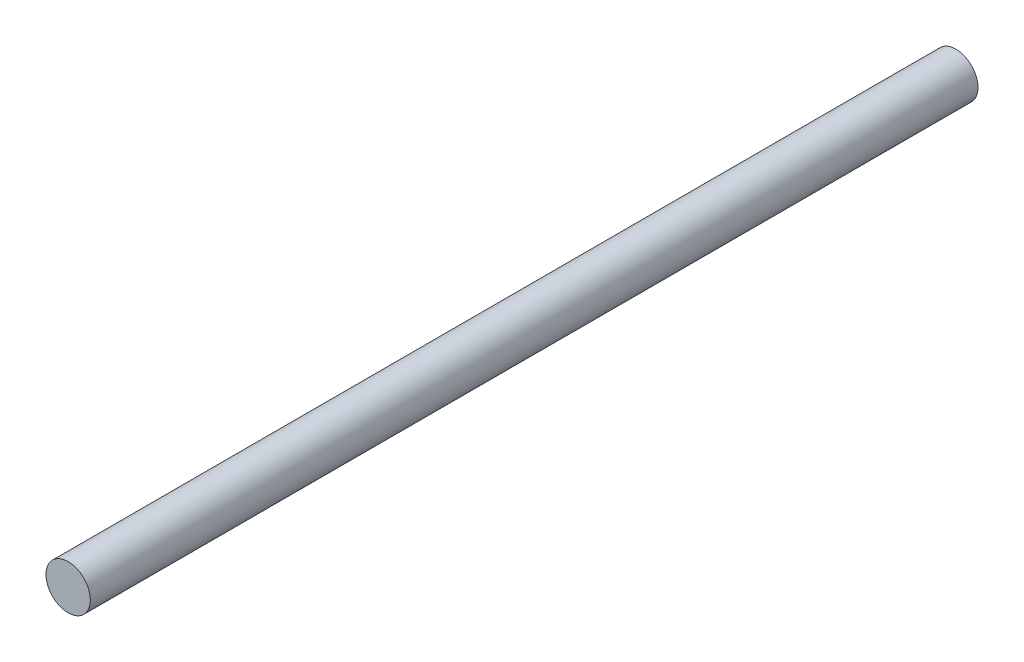
ISO-10303-21;
HEADER;
FILE_DESCRIPTION(('STEP AP214'),'2;1');
FILE_NAME('part.step','',(''),(''),'','','');
FILE_SCHEMA(('AUTOMOTIVE_DESIGN { 1 0 10303 214 1 1 1 1 }'));
ENDSEC;
DATA;
#1=APPLICATION_CONTEXT('core data for automotive mechanical design processes');
#2=APPLICATION_PROTOCOL_DEFINITION('international standard','automotive_design',2000,#1);
#3=PRODUCT_CONTEXT('',#1,'mechanical');
#4=PRODUCT('Part','Part','',(#3));
#5=PRODUCT_RELATED_PRODUCT_CATEGORY('part','',(#4));
#6=PRODUCT_DEFINITION_FORMATION('','',#4);
#7=PRODUCT_DEFINITION_CONTEXT('part definition',#1,'design');
#8=PRODUCT_DEFINITION('design','',#6,#7);
#9=PRODUCT_DEFINITION_SHAPE('','',#8);
#10=(LENGTH_UNIT() NAMED_UNIT(*) SI_UNIT(.MILLI.,.METRE.));
#11=(NAMED_UNIT(*) PLANE_ANGLE_UNIT() SI_UNIT($,.RADIAN.));
#12=(NAMED_UNIT(*) SI_UNIT($,.STERADIAN.) SOLID_ANGLE_UNIT());
#13=UNCERTAINTY_MEASURE_WITH_UNIT(LENGTH_MEASURE(1.E-05),#10,'distance_accuracy_value','');
#14=(GEOMETRIC_REPRESENTATION_CONTEXT(3) GLOBAL_UNCERTAINTY_ASSIGNED_CONTEXT((#13)) GLOBAL_UNIT_ASSIGNED_CONTEXT((#10,
#11,#12)) REPRESENTATION_CONTEXT('',''));
#15=CARTESIAN_POINT('',(0.,0.,0.));
#16=DIRECTION('',(0.,0.,1.));
#17=DIRECTION('',(1.,0.,0.));
#18=AXIS2_PLACEMENT_3D('',#15,#16,#17);
#19=CARTESIAN_POINT('',(0.,0.,400.));
#20=DIRECTION('',(0.,0.,-1.));
#21=DIRECTION('',(-1.,0.,0.));
#22=AXIS2_PLACEMENT_3D('',#19,#20,#21);
#23=CYLINDRICAL_SURFACE('',#22,10.);
#24=CARTESIAN_POINT('',(0.,0.,400.));
#25=DIRECTION('',(0.,0.,1.));
#26=DIRECTION('',(1.,0.,0.));
#27=AXIS2_PLACEMENT_3D('',#24,#25,#26);
#28=CIRCLE('',#27,10.);
#29=CARTESIAN_POINT('',(10.,0.,400.));
#30=VERTEX_POINT('',#29);
#31=EDGE_CURVE('E10',#30,#30,#28,.T.);
#32=ORIENTED_EDGE('',*,*,#31,.F.);
#33=EDGE_LOOP('',(#32));
#34=FACE_BOUND('',#33,.T.);
#35=CARTESIAN_POINT('',(0.,0.,0.));
#36=DIRECTION('',(0.,0.,1.));
#37=DIRECTION('',(1.,0.,0.));
#38=AXIS2_PLACEMENT_3D('',#35,#36,#37);
#39=CIRCLE('',#38,10.);
#40=CARTESIAN_POINT('',(10.,0.,0.));
#41=VERTEX_POINT('',#40);
#42=EDGE_CURVE('E36',#41,#41,#39,.T.);
#43=ORIENTED_EDGE('',*,*,#42,.T.);
#44=EDGE_LOOP('',(#43));
#45=FACE_BOUND('',#44,.T.);
#46=ADVANCED_FACE('F33',(#34,#45),#23,.T.);
#47=CARTESIAN_POINT('',(0.,0.,400.));
#48=DIRECTION('',(0.,0.,1.));
#49=DIRECTION('',(1.,0.,0.));
#50=AXIS2_PLACEMENT_3D('',#47,#48,#49);
#51=PLANE('',#50);
#52=ORIENTED_EDGE('',*,*,#31,.T.);
#53=EDGE_LOOP('',(#52));
#54=FACE_BOUND('',#53,.T.);
#55=ADVANCED_FACE('F48',(#54),#51,.T.);
#56=CARTESIAN_POINT('',(0.,0.,0.));
#57=DIRECTION('',(0.,0.,1.));
#58=DIRECTION('',(1.,0.,0.));
#59=AXIS2_PLACEMENT_3D('',#56,#57,#58);
#60=PLANE('',#59);
#61=ORIENTED_EDGE('',*,*,#42,.F.);
#62=EDGE_LOOP('',(#61));
#63=FACE_BOUND('',#62,.T.);
#64=ADVANCED_FACE('F46',(#63),#60,.F.);
#65=CLOSED_SHELL('',(#46,#55,#64));
#66=MANIFOLD_SOLID_BREP('B2',#65);
#67=ADVANCED_BREP_SHAPE_REPRESENTATION('',(#18,#66),#14);
#68=SHAPE_DEFINITION_REPRESENTATION(#9,#67);
ENDSEC;
END-ISO-10303-21;
